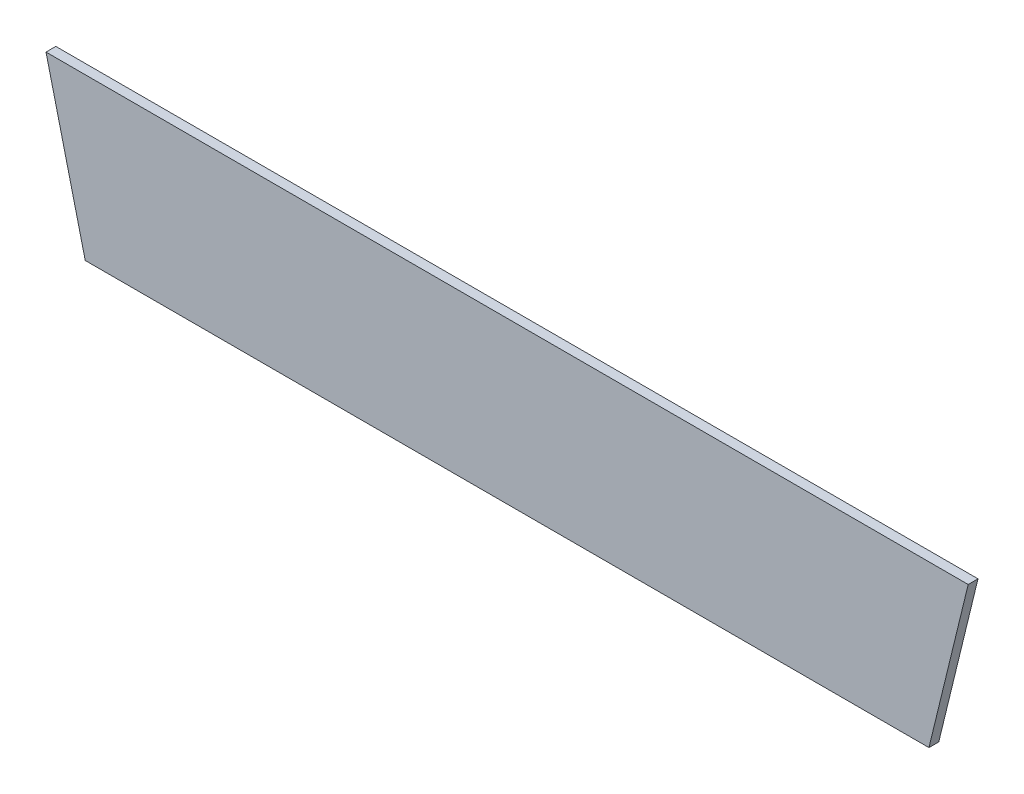
ISO-10303-21;
HEADER;
FILE_DESCRIPTION(('STEP AP214'),'2;1');
FILE_NAME('part.step','',(''),(''),'','','');
FILE_SCHEMA(('AUTOMOTIVE_DESIGN { 1 0 10303 214 1 1 1 1 }'));
ENDSEC;
DATA;
#1=APPLICATION_CONTEXT('core data for automotive mechanical design processes');
#2=APPLICATION_PROTOCOL_DEFINITION('international standard','automotive_design',2000,#1);
#3=PRODUCT_CONTEXT('',#1,'mechanical');
#4=PRODUCT('Part','Part','',(#3));
#5=PRODUCT_RELATED_PRODUCT_CATEGORY('part','',(#4));
#6=PRODUCT_DEFINITION_FORMATION('','',#4);
#7=PRODUCT_DEFINITION_CONTEXT('part definition',#1,'design');
#8=PRODUCT_DEFINITION('design','',#6,#7);
#9=PRODUCT_DEFINITION_SHAPE('','',#8);
#10=(LENGTH_UNIT() NAMED_UNIT(*) SI_UNIT(.MILLI.,.METRE.));
#11=(NAMED_UNIT(*) PLANE_ANGLE_UNIT() SI_UNIT($,.RADIAN.));
#12=(NAMED_UNIT(*) SI_UNIT($,.STERADIAN.) SOLID_ANGLE_UNIT());
#13=UNCERTAINTY_MEASURE_WITH_UNIT(LENGTH_MEASURE(1.E-05),#10,'distance_accuracy_value','');
#14=(GEOMETRIC_REPRESENTATION_CONTEXT(3) GLOBAL_UNCERTAINTY_ASSIGNED_CONTEXT((#13)) GLOBAL_UNIT_ASSIGNED_CONTEXT((#10,
#11,#12)) REPRESENTATION_CONTEXT('',''));
#15=CARTESIAN_POINT('',(0.,0.,0.));
#16=DIRECTION('',(0.,0.,1.));
#17=DIRECTION('',(1.,0.,0.));
#18=AXIS2_PLACEMENT_3D('',#15,#16,#17);
#19=CARTESIAN_POINT('',(2.35000038,0.41000172,0.0499999));
#20=DIRECTION('',(0.,0.,1.));
#21=DIRECTION('',(1.,0.,0.));
#22=AXIS2_PLACEMENT_3D('',#19,#20,#21);
#23=PLANE('',#22);
#24=DIRECTION('',(-1.,0.,0.));
#25=VECTOR('',#24,1.);
#26=CARTESIAN_POINT('',(2.15000078,-0.40999918,0.0499999));
#27=LINE('',#26,#25);
#28=CARTESIAN_POINT('',(2.15000078000008,-0.409999180000019,0.0499999));
#29=VERTEX_POINT('',#28);
#30=CARTESIAN_POINT('',(-2.15000078,-0.40999918,0.0499999));
#31=VERTEX_POINT('',#30);
#32=EDGE_CURVE('E74',#29,#31,#27,.T.);
#33=ORIENTED_EDGE('',*,*,#32,.F.);
#34=DIRECTION('',(0.236955487417398,0.971520507752041,0.));
#35=VECTOR('',#34,1.);
#36=CARTESIAN_POINT('',(2.15000078,-0.40999918,0.0499999));
#37=LINE('',#36,#35);
#38=CARTESIAN_POINT('',(2.35000038,0.41000172,0.0499999));
#39=VERTEX_POINT('',#38);
#40=EDGE_CURVE('E72',#29,#39,#37,.T.);
#41=ORIENTED_EDGE('',*,*,#40,.T.);
#42=DIRECTION('',(1.,0.,0.));
#43=VECTOR('',#42,1.);
#44=CARTESIAN_POINT('',(-2.35000038,0.41000172,0.0499999));
#45=LINE('',#44,#43);
#46=CARTESIAN_POINT('',(-2.35000037999992,0.410001720000019,0.0499999));
#47=VERTEX_POINT('',#46);
#48=EDGE_CURVE('E11',#47,#39,#45,.T.);
#49=ORIENTED_EDGE('',*,*,#48,.F.);
#50=DIRECTION('',(-0.236955487417032,0.97152050775213,0.));
#51=VECTOR('',#50,1.);
#52=CARTESIAN_POINT('',(-2.15000078,-0.40999918,0.0499999));
#53=LINE('',#52,#51);
#54=EDGE_CURVE('E20',#31,#47,#53,.T.);
#55=ORIENTED_EDGE('',*,*,#54,.F.);
#56=EDGE_LOOP('',(#33,#41,#49,#55));
#57=FACE_BOUND('',#56,.T.);
#58=ADVANCED_FACE('F16',(#57),#23,.T.);
#59=CARTESIAN_POINT('',(-2.35000038,0.41000172,0.));
#60=DIRECTION('',(0.,1.,0.));
#61=DIRECTION('',(1.,0.,0.));
#62=AXIS2_PLACEMENT_3D('',#59,#60,#61);
#63=PLANE('',#62);
#64=DIRECTION('',(0.,0.,1.));
#65=VECTOR('',#64,1.);
#66=CARTESIAN_POINT('',(2.35000038,0.41000172,0.));
#67=LINE('',#66,#65);
#68=CARTESIAN_POINT('',(2.35000038,0.41000172,0.));
#69=VERTEX_POINT('',#68);
#70=EDGE_CURVE('E67',#69,#39,#67,.T.);
#71=ORIENTED_EDGE('',*,*,#70,.F.);
#72=DIRECTION('',(-1.,0.,0.));
#73=VECTOR('',#72,1.);
#74=CARTESIAN_POINT('',(2.35000038,0.41000172,0.));
#75=LINE('',#74,#73);
#76=CARTESIAN_POINT('',(-2.35000037999992,0.410001720000019,0.));
#77=VERTEX_POINT('',#76);
#78=EDGE_CURVE('E93',#69,#77,#75,.T.);
#79=ORIENTED_EDGE('',*,*,#78,.T.);
#80=DIRECTION('',(0.,0.,-1.));
#81=VECTOR('',#80,1.);
#82=CARTESIAN_POINT('',(-2.35000037999969,0.410001720000075,0.));
#83=LINE('',#82,#81);
#84=EDGE_CURVE('E70',#47,#77,#83,.T.);
#85=ORIENTED_EDGE('',*,*,#84,.F.);
#86=ORIENTED_EDGE('',*,*,#48,.T.);
#87=EDGE_LOOP('',(#71,#79,#85,#86));
#88=FACE_BOUND('',#87,.T.);
#89=ADVANCED_FACE('F18',(#88),#63,.T.);
#90=CARTESIAN_POINT('',(-2.15000078,-0.40999918,0.));
#91=DIRECTION('',(-0.97152050775213,-0.236955487417032,0.));
#92=DIRECTION('',(-0.236955487417032,0.97152050775213,0.));
#93=AXIS2_PLACEMENT_3D('',#90,#91,#92);
#94=PLANE('',#93);
#95=ORIENTED_EDGE('',*,*,#84,.T.);
#96=DIRECTION('',(0.236955487417398,-0.971520507752041,0.));
#97=VECTOR('',#96,1.);
#98=CARTESIAN_POINT('',(-2.35000038,0.41000172,0.));
#99=LINE('',#98,#97);
#100=CARTESIAN_POINT('',(-2.15000078,-0.40999918,0.));
#101=VERTEX_POINT('',#100);
#102=EDGE_CURVE('E98',#77,#101,#99,.T.);
#103=ORIENTED_EDGE('',*,*,#102,.T.);
#104=DIRECTION('',(0.,0.,-1.));
#105=VECTOR('',#104,1.);
#106=CARTESIAN_POINT('',(-2.15000078,-0.40999918,0.));
#107=LINE('',#106,#105);
#108=EDGE_CURVE('E78',#31,#101,#107,.T.);
#109=ORIENTED_EDGE('',*,*,#108,.F.);
#110=ORIENTED_EDGE('',*,*,#54,.T.);
#111=EDGE_LOOP('',(#95,#103,#109,#110));
#112=FACE_BOUND('',#111,.T.);
#113=ADVANCED_FACE('F183',(#112),#94,.T.);
#114=CARTESIAN_POINT('',(2.15000078,-0.40999918,0.));
#115=DIRECTION('',(0.,-1.,0.));
#116=DIRECTION('',(0.,0.,-1.));
#117=AXIS2_PLACEMENT_3D('',#114,#115,#116);
#118=PLANE('',#117);
#119=ORIENTED_EDGE('',*,*,#108,.T.);
#120=DIRECTION('',(1.,0.,0.));
#121=VECTOR('',#120,1.);
#122=CARTESIAN_POINT('',(2.35000038,-0.40999918,0.));
#123=LINE('',#122,#121);
#124=CARTESIAN_POINT('',(2.15000078000008,-0.409999180000019,0.));
#125=VERTEX_POINT('',#124);
#126=EDGE_CURVE('E102',#101,#125,#123,.T.);
#127=ORIENTED_EDGE('',*,*,#126,.T.);
#128=DIRECTION('',(0.,0.,-1.));
#129=VECTOR('',#128,1.);
#130=CARTESIAN_POINT('',(2.15000078000031,-0.409999180000075,0.));
#131=LINE('',#130,#129);
#132=EDGE_CURVE('E85',#29,#125,#131,.T.);
#133=ORIENTED_EDGE('',*,*,#132,.F.);
#134=ORIENTED_EDGE('',*,*,#32,.T.);
#135=EDGE_LOOP('',(#119,#127,#133,#134));
#136=FACE_BOUND('',#135,.T.);
#137=ADVANCED_FACE('F111',(#136),#118,.T.);
#138=CARTESIAN_POINT('',(2.35000038,0.41000172,0.));
#139=DIRECTION('',(0.97152050775213,-0.236955487417032,0.));
#140=DIRECTION('',(0.,0.,-1.));
#141=AXIS2_PLACEMENT_3D('',#138,#139,#140);
#142=PLANE('',#141);
#143=ORIENTED_EDGE('',*,*,#132,.T.);
#144=DIRECTION('',(0.236955487417398,0.971520507752041,0.));
#145=VECTOR('',#144,1.);
#146=CARTESIAN_POINT('',(2.15000078,-0.40999918,0.));
#147=LINE('',#146,#145);
#148=EDGE_CURVE('E82',#125,#69,#147,.T.);
#149=ORIENTED_EDGE('',*,*,#148,.T.);
#150=ORIENTED_EDGE('',*,*,#70,.T.);
#151=ORIENTED_EDGE('',*,*,#40,.F.);
#152=EDGE_LOOP('',(#143,#149,#150,#151));
#153=FACE_BOUND('',#152,.T.);
#154=ADVANCED_FACE('F80',(#153),#142,.T.);
#155=CARTESIAN_POINT('',(2.35000038,0.41000172,0.));
#156=DIRECTION('',(0.,0.,1.));
#157=DIRECTION('',(1.,0.,0.));
#158=AXIS2_PLACEMENT_3D('',#155,#156,#157);
#159=PLANE('',#158);
#160=ORIENTED_EDGE('',*,*,#126,.F.);
#161=ORIENTED_EDGE('',*,*,#102,.F.);
#162=ORIENTED_EDGE('',*,*,#78,.F.);
#163=ORIENTED_EDGE('',*,*,#148,.F.);
#164=EDGE_LOOP('',(#160,#161,#162,#163));
#165=FACE_BOUND('',#164,.T.);
#166=ADVANCED_FACE('F115',(#165),#159,.F.);
#167=CLOSED_SHELL('',(#58,#89,#113,#137,#154,#166));
#168=MANIFOLD_SOLID_BREP('B1',#167);
#169=ADVANCED_BREP_SHAPE_REPRESENTATION('',(#18,#168),#14);
#170=SHAPE_DEFINITION_REPRESENTATION(#9,#169);
ENDSEC;
END-ISO-10303-21;
